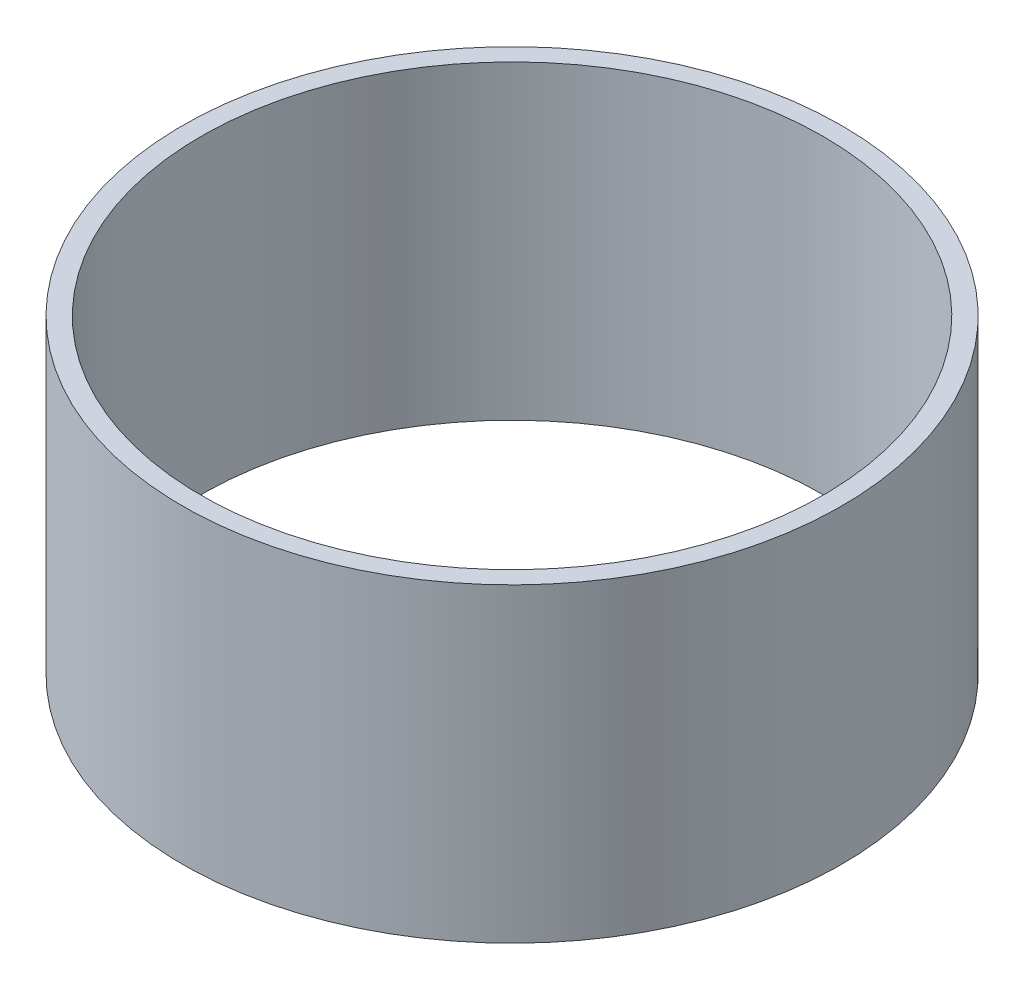
ISO-10303-21;
HEADER;
FILE_DESCRIPTION(('STEP AP214'),'2;1');
FILE_NAME('part.step','',(''),(''),'','','');
FILE_SCHEMA(('AUTOMOTIVE_DESIGN { 1 0 10303 214 1 1 1 1 }'));
ENDSEC;
DATA;
#1=APPLICATION_CONTEXT('core data for automotive mechanical design processes');
#2=APPLICATION_PROTOCOL_DEFINITION('international standard','automotive_design',2000,#1);
#3=PRODUCT_CONTEXT('',#1,'mechanical');
#4=PRODUCT('Part','Part','',(#3));
#5=PRODUCT_RELATED_PRODUCT_CATEGORY('part','',(#4));
#6=PRODUCT_DEFINITION_FORMATION('','',#4);
#7=PRODUCT_DEFINITION_CONTEXT('part definition',#1,'design');
#8=PRODUCT_DEFINITION('design','',#6,#7);
#9=PRODUCT_DEFINITION_SHAPE('','',#8);
#10=(LENGTH_UNIT() NAMED_UNIT(*) SI_UNIT(.MILLI.,.METRE.));
#11=(NAMED_UNIT(*) PLANE_ANGLE_UNIT() SI_UNIT($,.RADIAN.));
#12=(NAMED_UNIT(*) SI_UNIT($,.STERADIAN.) SOLID_ANGLE_UNIT());
#13=UNCERTAINTY_MEASURE_WITH_UNIT(LENGTH_MEASURE(1.E-05),#10,'distance_accuracy_value','');
#14=(GEOMETRIC_REPRESENTATION_CONTEXT(3) GLOBAL_UNCERTAINTY_ASSIGNED_CONTEXT((#13)) GLOBAL_UNIT_ASSIGNED_CONTEXT((#10,
#11,#12)) REPRESENTATION_CONTEXT('',''));
#15=CARTESIAN_POINT('',(0.,0.,0.));
#16=DIRECTION('',(0.,0.,1.));
#17=DIRECTION('',(1.,0.,0.));
#18=AXIS2_PLACEMENT_3D('',#15,#16,#17);
#19=CARTESIAN_POINT('',(0.,-13.97,0.));
#20=DIRECTION('',(0.,-1.,0.));
#21=DIRECTION('',(0.,0.,-1.));
#22=AXIS2_PLACEMENT_3D('',#19,#20,#21);
#23=CYLINDRICAL_SURFACE('',#22,25.4508);
#24=CARTESIAN_POINT('',(0.,0.,0.));
#25=DIRECTION('',(0.,-1.,0.));
#26=DIRECTION('',(0.,0.,-1.));
#27=AXIS2_PLACEMENT_3D('',#24,#25,#26);
#28=CIRCLE('',#27,25.4508);
#29=CARTESIAN_POINT('',(0.,0.,-25.4508));
#30=VERTEX_POINT('',#29);
#31=EDGE_CURVE('E50',#30,#30,#28,.T.);
#32=ORIENTED_EDGE('',*,*,#31,.T.);
#33=EDGE_LOOP('',(#32));
#34=FACE_BOUND('',#33,.T.);
#35=CARTESIAN_POINT('',(0.,25.4,0.));
#36=DIRECTION('',(0.,-1.,0.));
#37=DIRECTION('',(0.,0.,-1.));
#38=AXIS2_PLACEMENT_3D('',#35,#36,#37);
#39=CIRCLE('',#38,25.4508);
#40=CARTESIAN_POINT('',(0.,25.4,-25.4508));
#41=VERTEX_POINT('',#40);
#42=EDGE_CURVE('E10',#41,#41,#39,.T.);
#43=ORIENTED_EDGE('',*,*,#42,.F.);
#44=EDGE_LOOP('',(#43));
#45=FACE_BOUND('',#44,.T.);
#46=ADVANCED_FACE('F36',(#34,#45),#23,.F.);
#47=CARTESIAN_POINT('',(25.4508,25.4,0.));
#48=DIRECTION('',(0.,1.,0.));
#49=DIRECTION('',(0.,0.,1.));
#50=AXIS2_PLACEMENT_3D('',#47,#48,#49);
#51=PLANE('',#50);
#52=ORIENTED_EDGE('',*,*,#42,.T.);
#53=EDGE_LOOP('',(#52));
#54=FACE_BOUND('',#53,.T.);
#55=CARTESIAN_POINT('',(0.,25.4,0.));
#56=DIRECTION('',(0.,-1.,0.));
#57=DIRECTION('',(0.,0.,-1.));
#58=AXIS2_PLACEMENT_3D('',#55,#56,#57);
#59=CIRCLE('',#58,26.9748);
#60=CARTESIAN_POINT('',(0.,25.4,-26.9748));
#61=VERTEX_POINT('',#60);
#62=EDGE_CURVE('E42',#61,#61,#59,.T.);
#63=ORIENTED_EDGE('',*,*,#62,.F.);
#64=EDGE_LOOP('',(#63));
#65=FACE_BOUND('',#64,.T.);
#66=ADVANCED_FACE('F66',(#54,#65),#51,.T.);
#67=CARTESIAN_POINT('',(0.,-13.97,0.));
#68=DIRECTION('',(0.,-1.,0.));
#69=DIRECTION('',(0.,0.,-1.));
#70=AXIS2_PLACEMENT_3D('',#67,#68,#69);
#71=CYLINDRICAL_SURFACE('',#70,26.9748);
#72=ORIENTED_EDGE('',*,*,#62,.T.);
#73=EDGE_LOOP('',(#72));
#74=FACE_BOUND('',#73,.T.);
#75=CARTESIAN_POINT('',(0.,0.,0.));
#76=DIRECTION('',(0.,-1.,0.));
#77=DIRECTION('',(0.,0.,-1.));
#78=AXIS2_PLACEMENT_3D('',#75,#76,#77);
#79=CIRCLE('',#78,26.9748);
#80=CARTESIAN_POINT('',(0.,0.,-26.9748));
#81=VERTEX_POINT('',#80);
#82=EDGE_CURVE('E46',#81,#81,#79,.T.);
#83=ORIENTED_EDGE('',*,*,#82,.F.);
#84=EDGE_LOOP('',(#83));
#85=FACE_BOUND('',#84,.T.);
#86=ADVANCED_FACE('F60',(#74,#85),#71,.T.);
#87=CARTESIAN_POINT('',(25.4508,0.,0.));
#88=DIRECTION('',(0.,-1.,0.));
#89=DIRECTION('',(0.,0.,-1.));
#90=AXIS2_PLACEMENT_3D('',#87,#88,#89);
#91=PLANE('',#90);
#92=ORIENTED_EDGE('',*,*,#82,.T.);
#93=EDGE_LOOP('',(#92));
#94=FACE_BOUND('',#93,.T.);
#95=ORIENTED_EDGE('',*,*,#31,.F.);
#96=EDGE_LOOP('',(#95));
#97=FACE_BOUND('',#96,.T.);
#98=ADVANCED_FACE('F58',(#94,#97),#91,.T.);
#99=CLOSED_SHELL('',(#46,#66,#86,#98));
#100=MANIFOLD_SOLID_BREP('B2',#99);
#101=ADVANCED_BREP_SHAPE_REPRESENTATION('',(#18,#100),#14);
#102=SHAPE_DEFINITION_REPRESENTATION(#9,#101);
ENDSEC;
END-ISO-10303-21;
